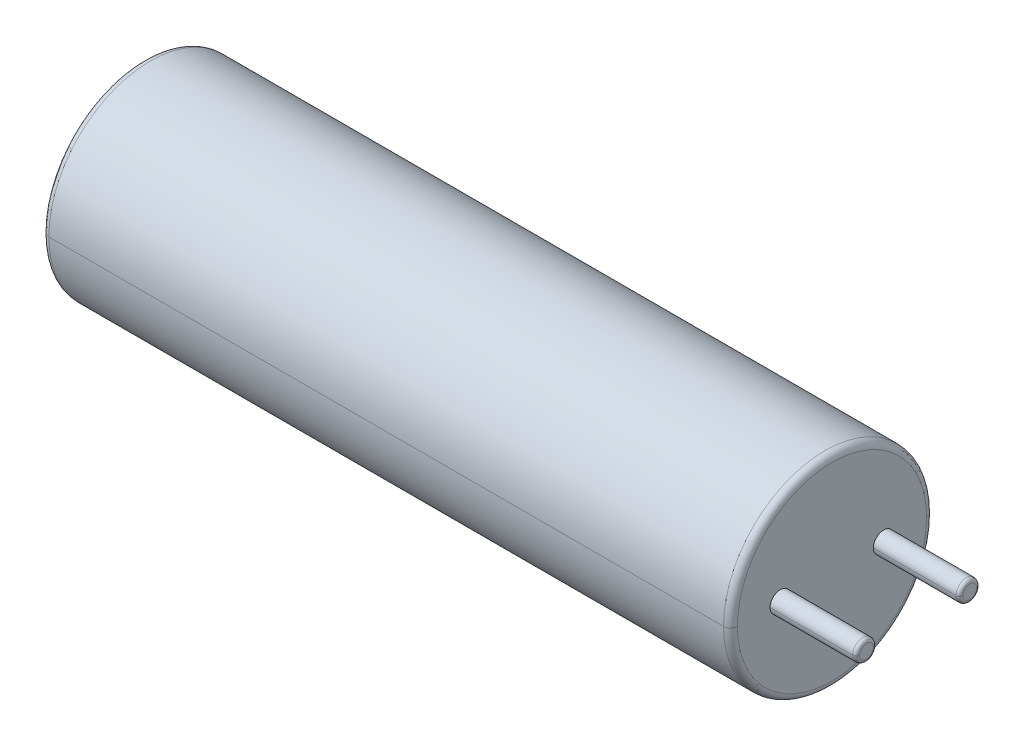
ISO-10303-21;
HEADER;
FILE_DESCRIPTION(('STEP AP214'),'2;1');
FILE_NAME('part.step','',(''),(''),'','','');
FILE_SCHEMA(('AUTOMOTIVE_DESIGN { 1 0 10303 214 1 1 1 1 }'));
ENDSEC;
DATA;
#1=APPLICATION_CONTEXT('core data for automotive mechanical design processes');
#2=APPLICATION_PROTOCOL_DEFINITION('international standard','automotive_design',2000,#1);
#3=PRODUCT_CONTEXT('',#1,'mechanical');
#4=PRODUCT('Part','Part','',(#3));
#5=PRODUCT_RELATED_PRODUCT_CATEGORY('part','',(#4));
#6=PRODUCT_DEFINITION_FORMATION('','',#4);
#7=PRODUCT_DEFINITION_CONTEXT('part definition',#1,'design');
#8=PRODUCT_DEFINITION('design','',#6,#7);
#9=PRODUCT_DEFINITION_SHAPE('','',#8);
#10=(LENGTH_UNIT() NAMED_UNIT(*) SI_UNIT(.MILLI.,.METRE.));
#11=(NAMED_UNIT(*) PLANE_ANGLE_UNIT() SI_UNIT($,.RADIAN.));
#12=(NAMED_UNIT(*) SI_UNIT($,.STERADIAN.) SOLID_ANGLE_UNIT());
#13=UNCERTAINTY_MEASURE_WITH_UNIT(LENGTH_MEASURE(1.E-05),#10,'distance_accuracy_value','');
#14=(GEOMETRIC_REPRESENTATION_CONTEXT(3) GLOBAL_UNCERTAINTY_ASSIGNED_CONTEXT((#13)) GLOBAL_UNIT_ASSIGNED_CONTEXT((#10,
#11,#12)) REPRESENTATION_CONTEXT('',''));
#15=CARTESIAN_POINT('',(0.,0.,0.));
#16=DIRECTION('',(0.,0.,1.));
#17=DIRECTION('',(1.,0.,0.));
#18=AXIS2_PLACEMENT_3D('',#15,#16,#17);
#19=CARTESIAN_POINT('',(9.8,0.,0.));
#20=DIRECTION('',(1.,0.,0.));
#21=DIRECTION('',(0.,0.,-1.));
#22=AXIS2_PLACEMENT_3D('',#19,#20,#21);
#23=TOROIDAL_SURFACE('',#22,2.75,0.2);
#24=CARTESIAN_POINT('',(9.8,0.,2.75));
#25=DIRECTION('',(0.,1.,0.));
#26=DIRECTION('',(0.,0.,1.));
#27=AXIS2_PLACEMENT_3D('',#24,#25,#26);
#28=CIRCLE('',#27,0.2);
#29=CARTESIAN_POINT('',(9.8,0.,2.95));
#30=VERTEX_POINT('',#29);
#31=CARTESIAN_POINT('',(10.,0.,2.75));
#32=VERTEX_POINT('',#31);
#33=EDGE_CURVE('E147',#30,#32,#28,.T.);
#34=ORIENTED_EDGE('',*,*,#33,.F.);
#35=CARTESIAN_POINT('',(9.8,0.,0.));
#36=DIRECTION('',(-1.,0.,0.));
#37=DIRECTION('',(0.,0.,-1.));
#38=AXIS2_PLACEMENT_3D('',#35,#36,#37);
#39=CIRCLE('',#38,2.95);
#40=CARTESIAN_POINT('',(9.8,0.,-2.95));
#41=VERTEX_POINT('',#40);
#42=EDGE_CURVE('E120',#41,#30,#39,.T.);
#43=ORIENTED_EDGE('',*,*,#42,.F.);
#44=CARTESIAN_POINT('',(9.8,0.,-2.75));
#45=DIRECTION('',(0.,-1.,0.));
#46=DIRECTION('',(0.,0.,-1.));
#47=AXIS2_PLACEMENT_3D('',#44,#45,#46);
#48=CIRCLE('',#47,0.2);
#49=CARTESIAN_POINT('',(10.,0.,-2.75));
#50=VERTEX_POINT('',#49);
#51=EDGE_CURVE('E156',#41,#50,#48,.T.);
#52=ORIENTED_EDGE('',*,*,#51,.T.);
#53=CARTESIAN_POINT('',(10.,0.,0.));
#54=DIRECTION('',(1.,0.,0.));
#55=DIRECTION('',(0.,0.,-1.));
#56=AXIS2_PLACEMENT_3D('',#53,#54,#55);
#57=CIRCLE('',#56,2.75);
#58=EDGE_CURVE('E148',#32,#50,#57,.T.);
#59=ORIENTED_EDGE('',*,*,#58,.F.);
#60=EDGE_LOOP('',(#34,#43,#52,#59));
#61=FACE_BOUND('',#60,.T.);
#62=ADVANCED_FACE('F17',(#61),#23,.T.);
#63=CARTESIAN_POINT('',(-9.8,0.,0.));
#64=DIRECTION('',(1.,0.,0.));
#65=DIRECTION('',(0.,0.,-1.));
#66=AXIS2_PLACEMENT_3D('',#63,#64,#65);
#67=TOROIDAL_SURFACE('',#66,2.75,0.2);
#68=CARTESIAN_POINT('',(-9.8,0.,2.75));
#69=DIRECTION('',(0.,1.,0.));
#70=DIRECTION('',(0.,0.,1.));
#71=AXIS2_PLACEMENT_3D('',#68,#69,#70);
#72=CIRCLE('',#71,0.2);
#73=CARTESIAN_POINT('',(-10.,0.,2.75));
#74=VERTEX_POINT('',#73);
#75=CARTESIAN_POINT('',(-9.8,0.,2.95));
#76=VERTEX_POINT('',#75);
#77=EDGE_CURVE('E175',#74,#76,#72,.T.);
#78=ORIENTED_EDGE('',*,*,#77,.F.);
#79=CARTESIAN_POINT('',(-10.,0.,0.));
#80=DIRECTION('',(-1.,0.,0.));
#81=DIRECTION('',(0.,0.,-1.));
#82=AXIS2_PLACEMENT_3D('',#79,#80,#81);
#83=CIRCLE('',#82,2.75);
#84=CARTESIAN_POINT('',(-10.,0.,-2.75));
#85=VERTEX_POINT('',#84);
#86=EDGE_CURVE('E132',#85,#74,#83,.T.);
#87=ORIENTED_EDGE('',*,*,#86,.F.);
#88=CARTESIAN_POINT('',(-9.8,0.,-2.75));
#89=DIRECTION('',(0.,-1.,0.));
#90=DIRECTION('',(0.,0.,-1.));
#91=AXIS2_PLACEMENT_3D('',#88,#89,#90);
#92=CIRCLE('',#91,0.2);
#93=CARTESIAN_POINT('',(-9.8,0.,-2.95));
#94=VERTEX_POINT('',#93);
#95=EDGE_CURVE('E180',#85,#94,#92,.T.);
#96=ORIENTED_EDGE('',*,*,#95,.T.);
#97=CARTESIAN_POINT('',(-9.8,0.,0.));
#98=DIRECTION('',(1.,0.,0.));
#99=DIRECTION('',(0.,0.,-1.));
#100=AXIS2_PLACEMENT_3D('',#97,#98,#99);
#101=CIRCLE('',#100,2.95);
#102=EDGE_CURVE('E133',#76,#94,#101,.T.);
#103=ORIENTED_EDGE('',*,*,#102,.F.);
#104=EDGE_LOOP('',(#78,#87,#96,#103));
#105=FACE_BOUND('',#104,.T.);
#106=ADVANCED_FACE('F276',(#105),#67,.T.);
#107=CARTESIAN_POINT('',(12.4,0.,-1.5));
#108=DIRECTION('',(1.,0.,0.));
#109=DIRECTION('',(0.,0.,-1.));
#110=AXIS2_PLACEMENT_3D('',#107,#108,#109);
#111=TOROIDAL_SURFACE('',#110,0.2,0.1);
#112=CARTESIAN_POINT('',(12.4,0.,-1.3));
#113=DIRECTION('',(0.,1.,0.));
#114=DIRECTION('',(0.,0.,1.));
#115=AXIS2_PLACEMENT_3D('',#112,#113,#114);
#116=CIRCLE('',#115,0.1);
#117=CARTESIAN_POINT('',(12.4,0.,-1.2));
#118=VERTEX_POINT('',#117);
#119=CARTESIAN_POINT('',(12.5,0.,-1.3));
#120=VERTEX_POINT('',#119);
#121=EDGE_CURVE('E191',#118,#120,#116,.T.);
#122=ORIENTED_EDGE('',*,*,#121,.F.);
#123=CARTESIAN_POINT('',(12.4,0.,-1.5));
#124=DIRECTION('',(-1.,0.,0.));
#125=DIRECTION('',(0.,0.,-1.));
#126=AXIS2_PLACEMENT_3D('',#123,#124,#125);
#127=CIRCLE('',#126,0.3);
#128=CARTESIAN_POINT('',(12.4,0.,-1.8));
#129=VERTEX_POINT('',#128);
#130=EDGE_CURVE('E25',#129,#118,#127,.T.);
#131=ORIENTED_EDGE('',*,*,#130,.F.);
#132=CARTESIAN_POINT('',(12.4,0.,-1.7));
#133=DIRECTION('',(0.,-1.,0.));
#134=DIRECTION('',(0.,0.,-1.));
#135=AXIS2_PLACEMENT_3D('',#132,#133,#134);
#136=CIRCLE('',#135,0.1);
#137=CARTESIAN_POINT('',(12.5,0.,-1.7));
#138=VERTEX_POINT('',#137);
#139=EDGE_CURVE('E185',#129,#138,#136,.T.);
#140=ORIENTED_EDGE('',*,*,#139,.T.);
#141=CARTESIAN_POINT('',(12.5,0.,-1.5));
#142=DIRECTION('',(1.,0.,0.));
#143=DIRECTION('',(0.,0.,-1.));
#144=AXIS2_PLACEMENT_3D('',#141,#142,#143);
#145=CIRCLE('',#144,0.2);
#146=EDGE_CURVE('E11',#120,#138,#145,.T.);
#147=ORIENTED_EDGE('',*,*,#146,.F.);
#148=EDGE_LOOP('',(#122,#131,#140,#147));
#149=FACE_BOUND('',#148,.T.);
#150=ADVANCED_FACE('F256',(#149),#111,.T.);
#151=CARTESIAN_POINT('',(12.4,0.,1.5));
#152=DIRECTION('',(1.,0.,0.));
#153=DIRECTION('',(0.,0.,-1.));
#154=AXIS2_PLACEMENT_3D('',#151,#152,#153);
#155=TOROIDAL_SURFACE('',#154,0.2,0.1);
#156=CARTESIAN_POINT('',(12.4,0.,1.7));
#157=DIRECTION('',(0.,1.,0.));
#158=DIRECTION('',(0.,0.,1.));
#159=AXIS2_PLACEMENT_3D('',#156,#157,#158);
#160=CIRCLE('',#159,0.1);
#161=CARTESIAN_POINT('',(12.4,0.,1.8));
#162=VERTEX_POINT('',#161);
#163=CARTESIAN_POINT('',(12.5,0.,1.7));
#164=VERTEX_POINT('',#163);
#165=EDGE_CURVE('E170',#162,#164,#160,.T.);
#166=ORIENTED_EDGE('',*,*,#165,.F.);
#167=CARTESIAN_POINT('',(12.4,0.,1.5));
#168=DIRECTION('',(-1.,0.,0.));
#169=DIRECTION('',(0.,0.,-1.));
#170=AXIS2_PLACEMENT_3D('',#167,#168,#169);
#171=CIRCLE('',#170,0.3);
#172=CARTESIAN_POINT('',(12.4,0.,1.2));
#173=VERTEX_POINT('',#172);
#174=EDGE_CURVE('E237',#173,#162,#171,.T.);
#175=ORIENTED_EDGE('',*,*,#174,.F.);
#176=CARTESIAN_POINT('',(12.4,0.,1.3));
#177=DIRECTION('',(0.,-1.,0.));
#178=DIRECTION('',(0.,0.,-1.));
#179=AXIS2_PLACEMENT_3D('',#176,#177,#178);
#180=CIRCLE('',#179,0.1);
#181=CARTESIAN_POINT('',(12.5,0.,1.3));
#182=VERTEX_POINT('',#181);
#183=EDGE_CURVE('E169',#173,#182,#180,.T.);
#184=ORIENTED_EDGE('',*,*,#183,.T.);
#185=CARTESIAN_POINT('',(12.5,0.,1.5));
#186=DIRECTION('',(1.,0.,0.));
#187=DIRECTION('',(0.,0.,-1.));
#188=AXIS2_PLACEMENT_3D('',#185,#186,#187);
#189=CIRCLE('',#188,0.2);
#190=EDGE_CURVE('E240',#164,#182,#189,.T.);
#191=ORIENTED_EDGE('',*,*,#190,.F.);
#192=EDGE_LOOP('',(#166,#175,#184,#191));
#193=FACE_BOUND('',#192,.T.);
#194=ADVANCED_FACE('F302',(#193),#155,.T.);
#195=CARTESIAN_POINT('',(12.5,0.,-1.5));
#196=DIRECTION('',(1.,0.,0.));
#197=DIRECTION('',(0.,1.,0.));
#198=AXIS2_PLACEMENT_3D('',#195,#196,#197);
#199=PLANE('',#198);
#200=CARTESIAN_POINT('',(12.5,0.,-1.5));
#201=DIRECTION('',(1.,0.,0.));
#202=DIRECTION('',(0.,0.,-1.));
#203=AXIS2_PLACEMENT_3D('',#200,#201,#202);
#204=CIRCLE('',#203,0.2);
#205=EDGE_CURVE('E190',#138,#120,#204,.T.);
#206=ORIENTED_EDGE('',*,*,#205,.T.);
#207=ORIENTED_EDGE('',*,*,#146,.T.);
#208=EDGE_LOOP('',(#206,#207));
#209=FACE_BOUND('',#208,.T.);
#210=ADVANCED_FACE('F305',(#209),#199,.T.);
#211=CARTESIAN_POINT('',(12.5,0.,-1.5));
#212=DIRECTION('',(-1.,0.,0.));
#213=DIRECTION('',(0.,0.,1.));
#214=AXIS2_PLACEMENT_3D('',#211,#212,#213);
#215=CYLINDRICAL_SURFACE('',#214,0.3);
#216=DIRECTION('',(-1.,0.,0.));
#217=VECTOR('',#216,1.);
#218=CARTESIAN_POINT('',(12.5,0.,-1.8));
#219=LINE('',#218,#217);
#220=CARTESIAN_POINT('',(10.,0.,-1.8));
#221=VERTEX_POINT('',#220);
#222=EDGE_CURVE('E204',#129,#221,#219,.T.);
#223=ORIENTED_EDGE('',*,*,#222,.F.);
#224=ORIENTED_EDGE('',*,*,#130,.T.);
#225=DIRECTION('',(-1.,0.,0.));
#226=VECTOR('',#225,1.);
#227=CARTESIAN_POINT('',(12.5,0.,-1.2));
#228=LINE('',#227,#226);
#229=CARTESIAN_POINT('',(10.,0.,-1.2));
#230=VERTEX_POINT('',#229);
#231=EDGE_CURVE('E212',#118,#230,#228,.T.);
#232=ORIENTED_EDGE('',*,*,#231,.T.);
#233=CARTESIAN_POINT('',(10.,0.,-1.5));
#234=DIRECTION('',(1.,0.,0.));
#235=DIRECTION('',(0.,0.,-1.));
#236=AXIS2_PLACEMENT_3D('',#233,#234,#235);
#237=CIRCLE('',#236,0.3);
#238=EDGE_CURVE('E232',#230,#221,#237,.T.);
#239=ORIENTED_EDGE('',*,*,#238,.T.);
#240=EDGE_LOOP('',(#223,#224,#232,#239));
#241=FACE_BOUND('',#240,.T.);
#242=ADVANCED_FACE('F248',(#241),#215,.T.);
#243=CARTESIAN_POINT('',(12.5,0.,1.5));
#244=DIRECTION('',(1.,0.,0.));
#245=DIRECTION('',(0.,1.,0.));
#246=AXIS2_PLACEMENT_3D('',#243,#244,#245);
#247=PLANE('',#246);
#248=CARTESIAN_POINT('',(12.5,0.,1.5));
#249=DIRECTION('',(1.,0.,0.));
#250=DIRECTION('',(0.,0.,-1.));
#251=AXIS2_PLACEMENT_3D('',#248,#249,#250);
#252=CIRCLE('',#251,0.2);
#253=EDGE_CURVE('E165',#182,#164,#252,.T.);
#254=ORIENTED_EDGE('',*,*,#253,.T.);
#255=ORIENTED_EDGE('',*,*,#190,.T.);
#256=EDGE_LOOP('',(#254,#255));
#257=FACE_BOUND('',#256,.T.);
#258=ADVANCED_FACE('F311',(#257),#247,.T.);
#259=CARTESIAN_POINT('',(12.5,0.,1.5));
#260=DIRECTION('',(-1.,0.,0.));
#261=DIRECTION('',(0.,0.,1.));
#262=AXIS2_PLACEMENT_3D('',#259,#260,#261);
#263=CYLINDRICAL_SURFACE('',#262,0.3);
#264=DIRECTION('',(-1.,0.,0.));
#265=VECTOR('',#264,1.);
#266=CARTESIAN_POINT('',(12.5,0.,1.2));
#267=LINE('',#266,#265);
#268=CARTESIAN_POINT('',(10.,0.,1.2));
#269=VERTEX_POINT('',#268);
#270=EDGE_CURVE('E216',#173,#269,#267,.T.);
#271=ORIENTED_EDGE('',*,*,#270,.F.);
#272=ORIENTED_EDGE('',*,*,#174,.T.);
#273=DIRECTION('',(-1.,0.,0.));
#274=VECTOR('',#273,1.);
#275=CARTESIAN_POINT('',(12.5,0.,1.8));
#276=LINE('',#275,#274);
#277=CARTESIAN_POINT('',(10.,0.,1.8));
#278=VERTEX_POINT('',#277);
#279=EDGE_CURVE('E144',#162,#278,#276,.T.);
#280=ORIENTED_EDGE('',*,*,#279,.T.);
#281=CARTESIAN_POINT('',(10.,0.,1.5));
#282=DIRECTION('',(1.,0.,0.));
#283=DIRECTION('',(0.,0.,-1.));
#284=AXIS2_PLACEMENT_3D('',#281,#282,#283);
#285=CIRCLE('',#284,0.3);
#286=EDGE_CURVE('E37',#278,#269,#285,.T.);
#287=ORIENTED_EDGE('',*,*,#286,.T.);
#288=EDGE_LOOP('',(#271,#272,#280,#287));
#289=FACE_BOUND('',#288,.T.);
#290=ADVANCED_FACE('F291',(#289),#263,.T.);
#291=CARTESIAN_POINT('',(10.,0.,0.));
#292=DIRECTION('',(1.,0.,0.));
#293=DIRECTION('',(0.,1.,0.));
#294=AXIS2_PLACEMENT_3D('',#291,#292,#293);
#295=PLANE('',#294);
#296=ORIENTED_EDGE('',*,*,#286,.F.);
#297=CARTESIAN_POINT('',(10.,0.,1.5));
#298=DIRECTION('',(1.,0.,0.));
#299=DIRECTION('',(0.,0.,-1.));
#300=AXIS2_PLACEMENT_3D('',#297,#298,#299);
#301=CIRCLE('',#300,0.3);
#302=EDGE_CURVE('E220',#269,#278,#301,.T.);
#303=ORIENTED_EDGE('',*,*,#302,.F.);
#304=EDGE_LOOP('',(#296,#303));
#305=FACE_BOUND('',#304,.T.);
#306=ORIENTED_EDGE('',*,*,#238,.F.);
#307=CARTESIAN_POINT('',(10.,0.,-1.5));
#308=DIRECTION('',(1.,0.,0.));
#309=DIRECTION('',(0.,0.,-1.));
#310=AXIS2_PLACEMENT_3D('',#307,#308,#309);
#311=CIRCLE('',#310,0.3);
#312=EDGE_CURVE('E208',#221,#230,#311,.T.);
#313=ORIENTED_EDGE('',*,*,#312,.F.);
#314=EDGE_LOOP('',(#306,#313));
#315=FACE_BOUND('',#314,.T.);
#316=CARTESIAN_POINT('',(10.,0.,0.));
#317=DIRECTION('',(1.,0.,0.));
#318=DIRECTION('',(0.,0.,-1.));
#319=AXIS2_PLACEMENT_3D('',#316,#317,#318);
#320=CIRCLE('',#319,2.75);
#321=EDGE_CURVE('E153',#50,#32,#320,.T.);
#322=ORIENTED_EDGE('',*,*,#321,.T.);
#323=ORIENTED_EDGE('',*,*,#58,.T.);
#324=EDGE_LOOP('',(#322,#323));
#325=FACE_BOUND('',#324,.T.);
#326=ADVANCED_FACE('F283',(#305,#315,#325),#295,.T.);
#327=CARTESIAN_POINT('',(-10.,0.,0.));
#328=DIRECTION('',(1.,0.,0.));
#329=DIRECTION('',(0.,1.,0.));
#330=AXIS2_PLACEMENT_3D('',#327,#328,#329);
#331=PLANE('',#330);
#332=ORIENTED_EDGE('',*,*,#86,.T.);
#333=CARTESIAN_POINT('',(-10.,0.,0.));
#334=DIRECTION('',(-1.,0.,0.));
#335=DIRECTION('',(0.,0.,-1.));
#336=AXIS2_PLACEMENT_3D('',#333,#334,#335);
#337=CIRCLE('',#336,2.75);
#338=EDGE_CURVE('E171',#74,#85,#337,.T.);
#339=ORIENTED_EDGE('',*,*,#338,.T.);
#340=EDGE_LOOP('',(#332,#339));
#341=FACE_BOUND('',#340,.T.);
#342=ADVANCED_FACE('F281',(#341),#331,.F.);
#343=CARTESIAN_POINT('',(-10.,0.,0.));
#344=DIRECTION('',(1.,0.,0.));
#345=DIRECTION('',(0.,0.,-1.));
#346=AXIS2_PLACEMENT_3D('',#343,#344,#345);
#347=CYLINDRICAL_SURFACE('',#346,2.95);
#348=DIRECTION('',(1.,0.,0.));
#349=VECTOR('',#348,1.);
#350=CARTESIAN_POINT('',(-10.,0.,2.95));
#351=LINE('',#350,#349);
#352=EDGE_CURVE('E123',#76,#30,#351,.T.);
#353=ORIENTED_EDGE('',*,*,#352,.F.);
#354=ORIENTED_EDGE('',*,*,#102,.T.);
#355=DIRECTION('',(1.,0.,0.));
#356=VECTOR('',#355,1.);
#357=CARTESIAN_POINT('',(-10.,0.,-2.95));
#358=LINE('',#357,#356);
#359=EDGE_CURVE('E126',#94,#41,#358,.T.);
#360=ORIENTED_EDGE('',*,*,#359,.T.);
#361=ORIENTED_EDGE('',*,*,#42,.T.);
#362=EDGE_LOOP('',(#353,#354,#360,#361));
#363=FACE_BOUND('',#362,.T.);
#364=ADVANCED_FACE('F122',(#363),#347,.T.);
#365=CARTESIAN_POINT('',(-10.,0.,0.));
#366=DIRECTION('',(1.,0.,0.));
#367=DIRECTION('',(0.,0.,-1.));
#368=AXIS2_PLACEMENT_3D('',#365,#366,#367);
#369=CYLINDRICAL_SURFACE('',#368,2.95);
#370=CARTESIAN_POINT('',(-9.8,0.,0.));
#371=DIRECTION('',(1.,0.,0.));
#372=DIRECTION('',(0.,0.,-1.));
#373=AXIS2_PLACEMENT_3D('',#370,#371,#372);
#374=CIRCLE('',#373,2.95);
#375=EDGE_CURVE('E141',#94,#76,#374,.T.);
#376=ORIENTED_EDGE('',*,*,#375,.T.);
#377=ORIENTED_EDGE('',*,*,#352,.T.);
#378=CARTESIAN_POINT('',(9.8,0.,0.));
#379=DIRECTION('',(-1.,0.,0.));
#380=DIRECTION('',(0.,0.,-1.));
#381=AXIS2_PLACEMENT_3D('',#378,#379,#380);
#382=CIRCLE('',#381,2.95);
#383=EDGE_CURVE('E139',#30,#41,#382,.T.);
#384=ORIENTED_EDGE('',*,*,#383,.T.);
#385=ORIENTED_EDGE('',*,*,#359,.F.);
#386=EDGE_LOOP('',(#376,#377,#384,#385));
#387=FACE_BOUND('',#386,.T.);
#388=ADVANCED_FACE('F137',(#387),#369,.T.);
#389=CARTESIAN_POINT('',(12.5,0.,1.5));
#390=DIRECTION('',(-1.,0.,0.));
#391=DIRECTION('',(0.,0.,1.));
#392=AXIS2_PLACEMENT_3D('',#389,#390,#391);
#393=CYLINDRICAL_SURFACE('',#392,0.3);
#394=CARTESIAN_POINT('',(12.4,0.,1.5));
#395=DIRECTION('',(-1.,0.,0.));
#396=DIRECTION('',(0.,0.,-1.));
#397=AXIS2_PLACEMENT_3D('',#394,#395,#396);
#398=CIRCLE('',#397,0.3);
#399=EDGE_CURVE('E189',#162,#173,#398,.T.);
#400=ORIENTED_EDGE('',*,*,#399,.T.);
#401=ORIENTED_EDGE('',*,*,#270,.T.);
#402=ORIENTED_EDGE('',*,*,#302,.T.);
#403=ORIENTED_EDGE('',*,*,#279,.F.);
#404=EDGE_LOOP('',(#400,#401,#402,#403));
#405=FACE_BOUND('',#404,.T.);
#406=ADVANCED_FACE('F325',(#405),#393,.T.);
#407=CARTESIAN_POINT('',(12.5,0.,-1.5));
#408=DIRECTION('',(-1.,0.,0.));
#409=DIRECTION('',(0.,0.,1.));
#410=AXIS2_PLACEMENT_3D('',#407,#408,#409);
#411=CYLINDRICAL_SURFACE('',#410,0.3);
#412=CARTESIAN_POINT('',(12.4,0.,-1.5));
#413=DIRECTION('',(-1.,0.,0.));
#414=DIRECTION('',(0.,0.,-1.));
#415=AXIS2_PLACEMENT_3D('',#412,#413,#414);
#416=CIRCLE('',#415,0.3);
#417=EDGE_CURVE('E184',#118,#129,#416,.T.);
#418=ORIENTED_EDGE('',*,*,#417,.T.);
#419=ORIENTED_EDGE('',*,*,#222,.T.);
#420=ORIENTED_EDGE('',*,*,#312,.T.);
#421=ORIENTED_EDGE('',*,*,#231,.F.);
#422=EDGE_LOOP('',(#418,#419,#420,#421));
#423=FACE_BOUND('',#422,.T.);
#424=ADVANCED_FACE('F253',(#423),#411,.T.);
#425=CARTESIAN_POINT('',(12.4,0.,1.5));
#426=DIRECTION('',(1.,0.,0.));
#427=DIRECTION('',(0.,0.,-1.));
#428=AXIS2_PLACEMENT_3D('',#425,#426,#427);
#429=TOROIDAL_SURFACE('',#428,0.2,0.1);
#430=ORIENTED_EDGE('',*,*,#399,.F.);
#431=ORIENTED_EDGE('',*,*,#165,.T.);
#432=ORIENTED_EDGE('',*,*,#253,.F.);
#433=ORIENTED_EDGE('',*,*,#183,.F.);
#434=EDGE_LOOP('',(#430,#431,#432,#433));
#435=FACE_BOUND('',#434,.T.);
#436=ADVANCED_FACE('F324',(#435),#429,.T.);
#437=CARTESIAN_POINT('',(12.4,0.,-1.5));
#438=DIRECTION('',(1.,0.,0.));
#439=DIRECTION('',(0.,0.,-1.));
#440=AXIS2_PLACEMENT_3D('',#437,#438,#439);
#441=TOROIDAL_SURFACE('',#440,0.2,0.1);
#442=ORIENTED_EDGE('',*,*,#417,.F.);
#443=ORIENTED_EDGE('',*,*,#121,.T.);
#444=ORIENTED_EDGE('',*,*,#205,.F.);
#445=ORIENTED_EDGE('',*,*,#139,.F.);
#446=EDGE_LOOP('',(#442,#443,#444,#445));
#447=FACE_BOUND('',#446,.T.);
#448=ADVANCED_FACE('F260',(#447),#441,.T.);
#449=CARTESIAN_POINT('',(-9.8,0.,0.));
#450=DIRECTION('',(1.,0.,0.));
#451=DIRECTION('',(0.,0.,-1.));
#452=AXIS2_PLACEMENT_3D('',#449,#450,#451);
#453=TOROIDAL_SURFACE('',#452,2.75,0.2);
#454=ORIENTED_EDGE('',*,*,#338,.F.);
#455=ORIENTED_EDGE('',*,*,#77,.T.);
#456=ORIENTED_EDGE('',*,*,#375,.F.);
#457=ORIENTED_EDGE('',*,*,#95,.F.);
#458=EDGE_LOOP('',(#454,#455,#456,#457));
#459=FACE_BOUND('',#458,.T.);
#460=ADVANCED_FACE('F279',(#459),#453,.T.);
#461=CARTESIAN_POINT('',(9.8,0.,0.));
#462=DIRECTION('',(1.,0.,0.));
#463=DIRECTION('',(0.,0.,-1.));
#464=AXIS2_PLACEMENT_3D('',#461,#462,#463);
#465=TOROIDAL_SURFACE('',#464,2.75,0.2);
#466=ORIENTED_EDGE('',*,*,#383,.F.);
#467=ORIENTED_EDGE('',*,*,#33,.T.);
#468=ORIENTED_EDGE('',*,*,#321,.F.);
#469=ORIENTED_EDGE('',*,*,#51,.F.);
#470=EDGE_LOOP('',(#466,#467,#468,#469));
#471=FACE_BOUND('',#470,.T.);
#472=ADVANCED_FACE('F155',(#471),#465,.T.);
#473=CLOSED_SHELL('',(#62,#106,#150,#194,#210,#242,#258,#290,#326,#342,#364,#388,#406,#424,#436,
#448,#460,#472));
#474=MANIFOLD_SOLID_BREP('B1',#473);
#475=ADVANCED_BREP_SHAPE_REPRESENTATION('',(#18,#474),#14);
#476=SHAPE_DEFINITION_REPRESENTATION(#9,#475);
ENDSEC;
END-ISO-10303-21;
